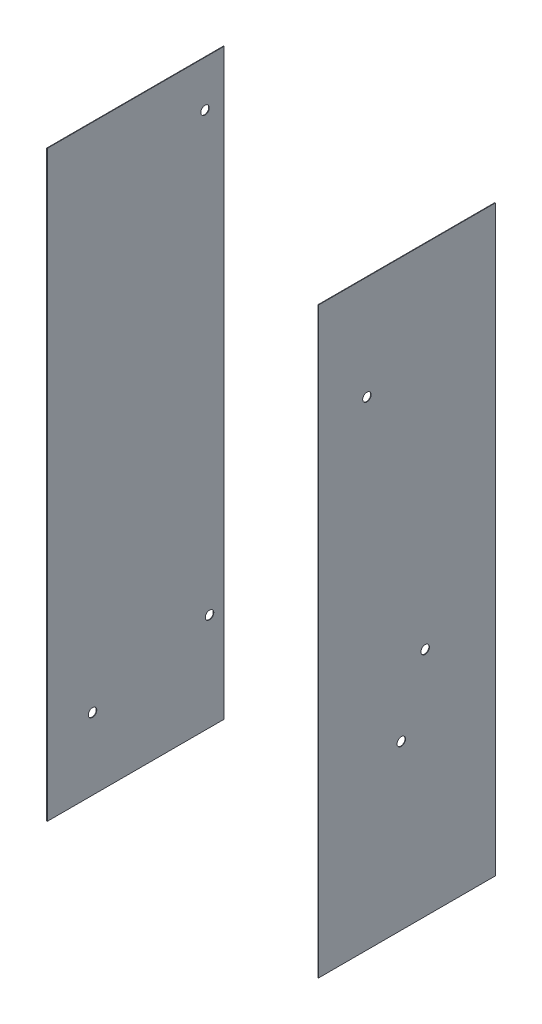
ISO-10303-21;
HEADER;
FILE_DESCRIPTION(('STEP AP214'),'2;1');
FILE_NAME('part.step','',(''),(''),'','','');
FILE_SCHEMA(('AUTOMOTIVE_DESIGN { 1 0 10303 214 1 1 1 1 }'));
ENDSEC;
DATA;
#1=APPLICATION_CONTEXT('core data for automotive mechanical design processes');
#2=APPLICATION_PROTOCOL_DEFINITION('international standard','automotive_design',2000,#1);
#3=PRODUCT_CONTEXT('',#1,'mechanical');
#4=PRODUCT('Part','Part','',(#3));
#5=PRODUCT_RELATED_PRODUCT_CATEGORY('part','',(#4));
#6=PRODUCT_DEFINITION_FORMATION('','',#4);
#7=PRODUCT_DEFINITION_CONTEXT('part definition',#1,'design');
#8=PRODUCT_DEFINITION('design','',#6,#7);
#9=PRODUCT_DEFINITION_SHAPE('','',#8);
#10=(LENGTH_UNIT() NAMED_UNIT(*) SI_UNIT(.MILLI.,.METRE.));
#11=(NAMED_UNIT(*) PLANE_ANGLE_UNIT() SI_UNIT($,.RADIAN.));
#12=(NAMED_UNIT(*) SI_UNIT($,.STERADIAN.) SOLID_ANGLE_UNIT());
#13=UNCERTAINTY_MEASURE_WITH_UNIT(LENGTH_MEASURE(1.E-05),#10,'distance_accuracy_value','');
#14=(GEOMETRIC_REPRESENTATION_CONTEXT(3) GLOBAL_UNCERTAINTY_ASSIGNED_CONTEXT((#13)) GLOBAL_UNIT_ASSIGNED_CONTEXT((#10,
#11,#12)) REPRESENTATION_CONTEXT('',''));
#15=CARTESIAN_POINT('',(0.,0.,0.));
#16=DIRECTION('',(0.,0.,1.));
#17=DIRECTION('',(1.,0.,0.));
#18=AXIS2_PLACEMENT_3D('',#15,#16,#17);
#19=CARTESIAN_POINT('',(-458.978,-984.25,-298.45));
#20=DIRECTION('',(0.,0.,1.));
#21=DIRECTION('',(-1.,0.,0.));
#22=AXIS2_PLACEMENT_3D('',#19,#20,#21);
#23=PLANE('',#22);
#24=DIRECTION('',(0.,1.,0.));
#25=VECTOR('',#24,1.);
#26=CARTESIAN_POINT('',(-457.2,-984.25,-298.45));
#27=LINE('',#26,#25);
#28=CARTESIAN_POINT('',(-457.2,-984.25,-298.45));
#29=VERTEX_POINT('',#28);
#30=CARTESIAN_POINT('',(-457.2,984.25,-298.45));
#31=VERTEX_POINT('',#30);
#32=EDGE_CURVE('E117',#29,#31,#27,.T.);
#33=ORIENTED_EDGE('',*,*,#32,.F.);
#34=DIRECTION('',(1.,0.,0.));
#35=VECTOR('',#34,1.);
#36=CARTESIAN_POINT('',(-458.978,-984.25,-298.45));
#37=LINE('',#36,#35);
#38=CARTESIAN_POINT('',(-458.978,-984.25,-298.45));
#39=VERTEX_POINT('',#38);
#40=EDGE_CURVE('E116',#39,#29,#37,.T.);
#41=ORIENTED_EDGE('',*,*,#40,.F.);
#42=DIRECTION('',(0.,1.,0.));
#43=VECTOR('',#42,1.);
#44=CARTESIAN_POINT('',(-458.978,-984.25,-298.45));
#45=LINE('',#44,#43);
#46=CARTESIAN_POINT('',(-458.978,984.25,-298.45));
#47=VERTEX_POINT('',#46);
#48=EDGE_CURVE('E110',#39,#47,#45,.T.);
#49=ORIENTED_EDGE('',*,*,#48,.T.);
#50=DIRECTION('',(1.,0.,0.));
#51=VECTOR('',#50,1.);
#52=CARTESIAN_POINT('',(-458.978,984.25,-298.45));
#53=LINE('',#52,#51);
#54=EDGE_CURVE('E12',#47,#31,#53,.T.);
#55=ORIENTED_EDGE('',*,*,#54,.T.);
#56=EDGE_LOOP('',(#33,#41,#49,#55));
#57=FACE_BOUND('',#56,.T.);
#58=ADVANCED_FACE('F50',(#57),#23,.F.);
#59=CARTESIAN_POINT('',(-458.978,984.25,-298.45));
#60=DIRECTION('',(0.,-1.,0.));
#61=DIRECTION('',(0.,0.,-1.));
#62=AXIS2_PLACEMENT_3D('',#59,#60,#61);
#63=PLANE('',#62);
#64=DIRECTION('',(0.,0.,1.));
#65=VECTOR('',#64,1.);
#66=CARTESIAN_POINT('',(-457.2,984.25,-298.45));
#67=LINE('',#66,#65);
#68=CARTESIAN_POINT('',(-457.2,984.25,298.45));
#69=VERTEX_POINT('',#68);
#70=EDGE_CURVE('E119',#31,#69,#67,.T.);
#71=ORIENTED_EDGE('',*,*,#70,.F.);
#72=ORIENTED_EDGE('',*,*,#54,.F.);
#73=DIRECTION('',(0.,0.,1.));
#74=VECTOR('',#73,1.);
#75=CARTESIAN_POINT('',(-458.978,984.25,-298.45));
#76=LINE('',#75,#74);
#77=CARTESIAN_POINT('',(-458.978,984.25,298.45));
#78=VERTEX_POINT('',#77);
#79=EDGE_CURVE('E93',#47,#78,#76,.T.);
#80=ORIENTED_EDGE('',*,*,#79,.T.);
#81=DIRECTION('',(1.,0.,0.));
#82=VECTOR('',#81,1.);
#83=CARTESIAN_POINT('',(-458.978,984.25,298.45));
#84=LINE('',#83,#82);
#85=EDGE_CURVE('E59',#78,#69,#84,.T.);
#86=ORIENTED_EDGE('',*,*,#85,.T.);
#87=EDGE_LOOP('',(#71,#72,#80,#86));
#88=FACE_BOUND('',#87,.T.);
#89=ADVANCED_FACE('F108',(#88),#63,.F.);
#90=CARTESIAN_POINT('',(-458.978,984.25,298.45));
#91=DIRECTION('',(0.,0.,-1.));
#92=DIRECTION('',(1.,0.,0.));
#93=AXIS2_PLACEMENT_3D('',#90,#91,#92);
#94=PLANE('',#93);
#95=DIRECTION('',(0.,-1.,0.));
#96=VECTOR('',#95,1.);
#97=CARTESIAN_POINT('',(-457.2,984.25,298.45));
#98=LINE('',#97,#96);
#99=CARTESIAN_POINT('',(-457.2,-984.25,298.45));
#100=VERTEX_POINT('',#99);
#101=EDGE_CURVE('E103',#69,#100,#98,.T.);
#102=ORIENTED_EDGE('',*,*,#101,.F.);
#103=ORIENTED_EDGE('',*,*,#85,.F.);
#104=DIRECTION('',(0.,-1.,0.));
#105=VECTOR('',#104,1.);
#106=CARTESIAN_POINT('',(-458.978,984.25,298.45));
#107=LINE('',#106,#105);
#108=CARTESIAN_POINT('',(-458.978,-984.25,298.45));
#109=VERTEX_POINT('',#108);
#110=EDGE_CURVE('E96',#78,#109,#107,.T.);
#111=ORIENTED_EDGE('',*,*,#110,.T.);
#112=DIRECTION('',(1.,0.,0.));
#113=VECTOR('',#112,1.);
#114=CARTESIAN_POINT('',(-458.978,-984.25,298.45));
#115=LINE('',#114,#113);
#116=EDGE_CURVE('E106',#109,#100,#115,.T.);
#117=ORIENTED_EDGE('',*,*,#116,.T.);
#118=EDGE_LOOP('',(#102,#103,#111,#117));
#119=FACE_BOUND('',#118,.T.);
#120=ADVANCED_FACE('F102',(#119),#94,.F.);
#121=CARTESIAN_POINT('',(-458.978,-984.25,298.45));
#122=DIRECTION('',(0.,1.,0.));
#123=DIRECTION('',(0.,0.,1.));
#124=AXIS2_PLACEMENT_3D('',#121,#122,#123);
#125=PLANE('',#124);
#126=DIRECTION('',(0.,0.,-1.));
#127=VECTOR('',#126,1.);
#128=CARTESIAN_POINT('',(-457.2,-984.25,298.45));
#129=LINE('',#128,#127);
#130=EDGE_CURVE('E82',#100,#29,#129,.T.);
#131=ORIENTED_EDGE('',*,*,#130,.F.);
#132=ORIENTED_EDGE('',*,*,#116,.F.);
#133=DIRECTION('',(0.,0.,-1.));
#134=VECTOR('',#133,1.);
#135=CARTESIAN_POINT('',(-458.978,-984.25,298.45));
#136=LINE('',#135,#134);
#137=EDGE_CURVE('E68',#109,#39,#136,.T.);
#138=ORIENTED_EDGE('',*,*,#137,.T.);
#139=ORIENTED_EDGE('',*,*,#40,.T.);
#140=EDGE_LOOP('',(#131,#132,#138,#139));
#141=FACE_BOUND('',#140,.T.);
#142=ADVANCED_FACE('F159',(#141),#125,.F.);
#143=CARTESIAN_POINT('',(-458.978,0.,0.));
#144=DIRECTION('',(-1.,0.,0.));
#145=DIRECTION('',(0.,0.,-1.));
#146=AXIS2_PLACEMENT_3D('',#143,#144,#145);
#147=PLANE('',#146);
#148=CARTESIAN_POINT('',(-458.978,-742.26734411053,145.541999999999));
#149=DIRECTION('',(-1.,0.,0.));
#150=DIRECTION('',(0.,0.,1.));
#151=AXIS2_PLACEMENT_3D('',#148,#149,#150);
#152=CIRCLE('',#151,14.2875000000001);
#153=CARTESIAN_POINT('',(-458.978,-742.26734411053,159.829499999999));
#154=VERTEX_POINT('',#153);
#155=EDGE_CURVE('E131',#154,#154,#152,.F.);
#156=ORIENTED_EDGE('',*,*,#155,.T.);
#157=EDGE_LOOP('',(#156));
#158=FACE_BOUND('',#157,.T.);
#159=CARTESIAN_POINT('',(-458.978,-654.63734411053,-249.669300000001));
#160=DIRECTION('',(-1.,0.,0.));
#161=DIRECTION('',(0.,0.,1.));
#162=AXIS2_PLACEMENT_3D('',#159,#160,#161);
#163=CIRCLE('',#162,14.2875000000001);
#164=CARTESIAN_POINT('',(-458.978,-654.63734411053,-235.381800000001));
#165=VERTEX_POINT('',#164);
#166=EDGE_CURVE('E128',#165,#165,#163,.F.);
#167=ORIENTED_EDGE('',*,*,#166,.T.);
#168=EDGE_LOOP('',(#167));
#169=FACE_BOUND('',#168,.T.);
#170=CARTESIAN_POINT('',(-458.978,829.52275588947,-234.315));
#171=DIRECTION('',(-1.,0.,0.));
#172=DIRECTION('',(0.,0.,1.));
#173=AXIS2_PLACEMENT_3D('',#170,#171,#172);
#174=CIRCLE('',#173,14.2875);
#175=CARTESIAN_POINT('',(-458.978,829.52275588947,-220.0275));
#176=VERTEX_POINT('',#175);
#177=EDGE_CURVE('E120',#176,#176,#174,.F.);
#178=ORIENTED_EDGE('',*,*,#177,.T.);
#179=EDGE_LOOP('',(#178));
#180=FACE_BOUND('',#179,.T.);
#181=ORIENTED_EDGE('',*,*,#48,.F.);
#182=ORIENTED_EDGE('',*,*,#137,.F.);
#183=ORIENTED_EDGE('',*,*,#110,.F.);
#184=ORIENTED_EDGE('',*,*,#79,.F.);
#185=EDGE_LOOP('',(#181,#182,#183,#184));
#186=FACE_BOUND('',#185,.T.);
#187=ADVANCED_FACE('F98',(#158,#169,#180,#186),#147,.T.);
#188=CARTESIAN_POINT('',(-457.2,0.,0.));
#189=DIRECTION('',(-1.,0.,0.));
#190=DIRECTION('',(0.,0.,-1.));
#191=AXIS2_PLACEMENT_3D('',#188,#189,#190);
#192=PLANE('',#191);
#193=CARTESIAN_POINT('',(-457.2,-742.26734411053,145.541999999999));
#194=DIRECTION('',(-1.,0.,0.));
#195=DIRECTION('',(0.,0.,1.));
#196=AXIS2_PLACEMENT_3D('',#193,#194,#195);
#197=CIRCLE('',#196,14.2875000000001);
#198=CARTESIAN_POINT('',(-457.2,-742.26734411053,159.829499999999));
#199=VERTEX_POINT('',#198);
#200=EDGE_CURVE('E53',#199,#199,#197,.F.);
#201=ORIENTED_EDGE('',*,*,#200,.F.);
#202=EDGE_LOOP('',(#201));
#203=FACE_BOUND('',#202,.T.);
#204=CARTESIAN_POINT('',(-457.2,-654.63734411053,-249.669300000001));
#205=DIRECTION('',(-1.,0.,0.));
#206=DIRECTION('',(0.,0.,1.));
#207=AXIS2_PLACEMENT_3D('',#204,#205,#206);
#208=CIRCLE('',#207,14.2875000000001);
#209=CARTESIAN_POINT('',(-457.2,-654.63734411053,-235.381800000001));
#210=VERTEX_POINT('',#209);
#211=EDGE_CURVE('E129',#210,#210,#208,.F.);
#212=ORIENTED_EDGE('',*,*,#211,.F.);
#213=EDGE_LOOP('',(#212));
#214=FACE_BOUND('',#213,.T.);
#215=CARTESIAN_POINT('',(-457.2,829.52275588947,-234.315));
#216=DIRECTION('',(-1.,0.,0.));
#217=DIRECTION('',(0.,0.,1.));
#218=AXIS2_PLACEMENT_3D('',#215,#216,#217);
#219=CIRCLE('',#218,14.2875);
#220=CARTESIAN_POINT('',(-457.2,829.52275588947,-220.0275));
#221=VERTEX_POINT('',#220);
#222=EDGE_CURVE('E126',#221,#221,#219,.F.);
#223=ORIENTED_EDGE('',*,*,#222,.F.);
#224=EDGE_LOOP('',(#223));
#225=FACE_BOUND('',#224,.T.);
#226=ORIENTED_EDGE('',*,*,#32,.T.);
#227=ORIENTED_EDGE('',*,*,#70,.T.);
#228=ORIENTED_EDGE('',*,*,#101,.T.);
#229=ORIENTED_EDGE('',*,*,#130,.T.);
#230=EDGE_LOOP('',(#226,#227,#228,#229));
#231=FACE_BOUND('',#230,.T.);
#232=ADVANCED_FACE('F149',(#203,#214,#225,#231),#192,.F.);
#233=CARTESIAN_POINT('',(-491.998,829.52275588947,-234.315));
#234=DIRECTION('',(1.,0.,0.));
#235=DIRECTION('',(0.,0.,-1.));
#236=AXIS2_PLACEMENT_3D('',#233,#234,#235);
#237=CYLINDRICAL_SURFACE('',#236,14.2875);
#238=ORIENTED_EDGE('',*,*,#177,.F.);
#239=EDGE_LOOP('',(#238));
#240=FACE_BOUND('',#239,.T.);
#241=ORIENTED_EDGE('',*,*,#222,.T.);
#242=EDGE_LOOP('',(#241));
#243=FACE_BOUND('',#242,.T.);
#244=ADVANCED_FACE('F145',(#240,#243),#237,.F.);
#245=CARTESIAN_POINT('',(-491.998,-654.63734411053,-249.669300000001));
#246=DIRECTION('',(1.,0.,0.));
#247=DIRECTION('',(0.,0.,-1.));
#248=AXIS2_PLACEMENT_3D('',#245,#246,#247);
#249=CYLINDRICAL_SURFACE('',#248,14.2875000000001);
#250=ORIENTED_EDGE('',*,*,#166,.F.);
#251=EDGE_LOOP('',(#250));
#252=FACE_BOUND('',#251,.T.);
#253=ORIENTED_EDGE('',*,*,#211,.T.);
#254=EDGE_LOOP('',(#253));
#255=FACE_BOUND('',#254,.T.);
#256=ADVANCED_FACE('F148',(#252,#255),#249,.F.);
#257=CARTESIAN_POINT('',(-491.998,-742.26734411053,145.541999999999));
#258=DIRECTION('',(1.,0.,0.));
#259=DIRECTION('',(0.,0.,-1.));
#260=AXIS2_PLACEMENT_3D('',#257,#258,#259);
#261=CYLINDRICAL_SURFACE('',#260,14.2875000000001);
#262=ORIENTED_EDGE('',*,*,#155,.F.);
#263=EDGE_LOOP('',(#262));
#264=FACE_BOUND('',#263,.T.);
#265=ORIENTED_EDGE('',*,*,#200,.T.);
#266=EDGE_LOOP('',(#265));
#267=FACE_BOUND('',#266,.T.);
#268=ADVANCED_FACE('F209',(#264,#267),#261,.F.);
#269=CLOSED_SHELL('',(#58,#89,#120,#142,#187,#232,#244,#256,#268));
#270=MANIFOLD_SOLID_BREP('B2',#269);
#271=CARTESIAN_POINT('',(458.978,-984.25,-298.45));
#272=DIRECTION('',(0.,0.,1.));
#273=DIRECTION('',(1.,0.,0.));
#274=AXIS2_PLACEMENT_3D('',#271,#272,#273);
#275=PLANE('',#274);
#276=DIRECTION('',(0.,1.,0.));
#277=VECTOR('',#276,1.);
#278=CARTESIAN_POINT('',(457.2,-984.25,-298.45));
#279=LINE('',#278,#277);
#280=CARTESIAN_POINT('',(457.2,-984.25,-298.45));
#281=VERTEX_POINT('',#280);
#282=CARTESIAN_POINT('',(457.2,984.25,-298.45));
#283=VERTEX_POINT('',#282);
#284=EDGE_CURVE('E313',#281,#283,#279,.T.);
#285=ORIENTED_EDGE('',*,*,#284,.T.);
#286=DIRECTION('',(-1.,0.,0.));
#287=VECTOR('',#286,1.);
#288=CARTESIAN_POINT('',(458.978,984.25,-298.45));
#289=LINE('',#288,#287);
#290=CARTESIAN_POINT('',(458.978,984.25,-298.45));
#291=VERTEX_POINT('',#290);
#292=EDGE_CURVE('E48',#291,#283,#289,.T.);
#293=ORIENTED_EDGE('',*,*,#292,.F.);
#294=DIRECTION('',(0.,1.,0.));
#295=VECTOR('',#294,1.);
#296=CARTESIAN_POINT('',(458.978,-984.25,-298.45));
#297=LINE('',#296,#295);
#298=CARTESIAN_POINT('',(458.978,-984.25,-298.45));
#299=VERTEX_POINT('',#298);
#300=EDGE_CURVE('E300',#299,#291,#297,.T.);
#301=ORIENTED_EDGE('',*,*,#300,.F.);
#302=DIRECTION('',(-1.,0.,0.));
#303=VECTOR('',#302,1.);
#304=CARTESIAN_POINT('',(458.978,-984.25,-298.45));
#305=LINE('',#304,#303);
#306=EDGE_CURVE('E309',#299,#281,#305,.T.);
#307=ORIENTED_EDGE('',*,*,#306,.T.);
#308=EDGE_LOOP('',(#285,#293,#301,#307));
#309=FACE_BOUND('',#308,.T.);
#310=ADVANCED_FACE('F247',(#309),#275,.F.);
#311=CARTESIAN_POINT('',(458.978,984.25,-298.45));
#312=DIRECTION('',(0.,-1.,0.));
#313=DIRECTION('',(0.,0.,-1.));
#314=AXIS2_PLACEMENT_3D('',#311,#312,#313);
#315=PLANE('',#314);
#316=DIRECTION('',(0.,0.,1.));
#317=VECTOR('',#316,1.);
#318=CARTESIAN_POINT('',(457.2,984.25,-298.45));
#319=LINE('',#318,#317);
#320=CARTESIAN_POINT('',(457.2,984.25,298.45));
#321=VERTEX_POINT('',#320);
#322=EDGE_CURVE('E304',#283,#321,#319,.T.);
#323=ORIENTED_EDGE('',*,*,#322,.T.);
#324=DIRECTION('',(-1.,0.,0.));
#325=VECTOR('',#324,1.);
#326=CARTESIAN_POINT('',(458.978,984.25,298.45));
#327=LINE('',#326,#325);
#328=CARTESIAN_POINT('',(458.978,984.25,298.45));
#329=VERTEX_POINT('',#328);
#330=EDGE_CURVE('E256',#329,#321,#327,.T.);
#331=ORIENTED_EDGE('',*,*,#330,.F.);
#332=DIRECTION('',(0.,0.,1.));
#333=VECTOR('',#332,1.);
#334=CARTESIAN_POINT('',(458.978,984.25,-298.45));
#335=LINE('',#334,#333);
#336=EDGE_CURVE('E295',#291,#329,#335,.T.);
#337=ORIENTED_EDGE('',*,*,#336,.F.);
#338=ORIENTED_EDGE('',*,*,#292,.T.);
#339=EDGE_LOOP('',(#323,#331,#337,#338));
#340=FACE_BOUND('',#339,.T.);
#341=ADVANCED_FACE('F303',(#340),#315,.F.);
#342=CARTESIAN_POINT('',(458.978,984.25,298.45));
#343=DIRECTION('',(0.,0.,-1.));
#344=DIRECTION('',(-1.,0.,0.));
#345=AXIS2_PLACEMENT_3D('',#342,#343,#344);
#346=PLANE('',#345);
#347=DIRECTION('',(0.,-1.,0.));
#348=VECTOR('',#347,1.);
#349=CARTESIAN_POINT('',(457.2,984.25,298.45));
#350=LINE('',#349,#348);
#351=CARTESIAN_POINT('',(457.2,-984.25,298.45));
#352=VERTEX_POINT('',#351);
#353=EDGE_CURVE('E282',#321,#352,#350,.T.);
#354=ORIENTED_EDGE('',*,*,#353,.T.);
#355=DIRECTION('',(-1.,0.,0.));
#356=VECTOR('',#355,1.);
#357=CARTESIAN_POINT('',(458.978,-984.25,298.45));
#358=LINE('',#357,#356);
#359=CARTESIAN_POINT('',(458.978,-984.25,298.45));
#360=VERTEX_POINT('',#359);
#361=EDGE_CURVE('E305',#360,#352,#358,.T.);
#362=ORIENTED_EDGE('',*,*,#361,.F.);
#363=DIRECTION('',(0.,-1.,0.));
#364=VECTOR('',#363,1.);
#365=CARTESIAN_POINT('',(458.978,984.25,298.45));
#366=LINE('',#365,#364);
#367=EDGE_CURVE('E298',#329,#360,#366,.T.);
#368=ORIENTED_EDGE('',*,*,#367,.F.);
#369=ORIENTED_EDGE('',*,*,#330,.T.);
#370=EDGE_LOOP('',(#354,#362,#368,#369));
#371=FACE_BOUND('',#370,.T.);
#372=ADVANCED_FACE('F307',(#371),#346,.F.);
#373=CARTESIAN_POINT('',(458.978,-984.25,298.45));
#374=DIRECTION('',(0.,1.,0.));
#375=DIRECTION('',(0.,0.,1.));
#376=AXIS2_PLACEMENT_3D('',#373,#374,#375);
#377=PLANE('',#376);
#378=DIRECTION('',(0.,0.,-1.));
#379=VECTOR('',#378,1.);
#380=CARTESIAN_POINT('',(457.2,-984.25,298.45));
#381=LINE('',#380,#379);
#382=EDGE_CURVE('E288',#352,#281,#381,.T.);
#383=ORIENTED_EDGE('',*,*,#382,.T.);
#384=ORIENTED_EDGE('',*,*,#306,.F.);
#385=DIRECTION('',(0.,0.,-1.));
#386=VECTOR('',#385,1.);
#387=CARTESIAN_POINT('',(458.978,-984.25,298.45));
#388=LINE('',#387,#386);
#389=EDGE_CURVE('E265',#360,#299,#388,.T.);
#390=ORIENTED_EDGE('',*,*,#389,.F.);
#391=ORIENTED_EDGE('',*,*,#361,.T.);
#392=EDGE_LOOP('',(#383,#384,#390,#391));
#393=FACE_BOUND('',#392,.T.);
#394=ADVANCED_FACE('F347',(#393),#377,.F.);
#395=CARTESIAN_POINT('',(458.978,0.,0.));
#396=DIRECTION('',(1.,0.,0.));
#397=DIRECTION('',(0.,0.,-1.));
#398=AXIS2_PLACEMENT_3D('',#395,#396,#397);
#399=PLANE('',#398);
#400=CARTESIAN_POINT('',(458.978,633.21184,135.025897322712));
#401=DIRECTION('',(1.,0.,0.));
#402=DIRECTION('',(0.,0.,-1.));
#403=AXIS2_PLACEMENT_3D('',#400,#401,#402);
#404=CIRCLE('',#403,14.2875);
#405=CARTESIAN_POINT('',(458.978,633.21184,120.738397322712));
#406=VERTEX_POINT('',#405);
#407=EDGE_CURVE('E336',#406,#406,#404,.T.);
#408=ORIENTED_EDGE('',*,*,#407,.F.);
#409=EDGE_LOOP('',(#408));
#410=FACE_BOUND('',#409,.T.);
#411=CARTESIAN_POINT('',(458.978,-432.196844110543,19.0499999999999));
#412=DIRECTION('',(1.,0.,0.));
#413=DIRECTION('',(0.,0.,-1.));
#414=AXIS2_PLACEMENT_3D('',#411,#412,#413);
#415=CIRCLE('',#414,14.2875);
#416=CARTESIAN_POINT('',(458.978,-432.196844110543,4.76249999999994));
#417=VERTEX_POINT('',#416);
#418=EDGE_CURVE('E326',#417,#417,#415,.T.);
#419=ORIENTED_EDGE('',*,*,#418,.F.);
#420=EDGE_LOOP('',(#419));
#421=FACE_BOUND('',#420,.T.);
#422=CARTESIAN_POINT('',(458.978,-203.419044110543,-61.7093000000001));
#423=DIRECTION('',(1.,0.,0.));
#424=DIRECTION('',(0.,0.,-1.));
#425=AXIS2_PLACEMENT_3D('',#422,#423,#424);
#426=CIRCLE('',#425,14.2875);
#427=CARTESIAN_POINT('',(458.978,-203.419044110543,-75.9968000000001));
#428=VERTEX_POINT('',#427);
#429=EDGE_CURVE('E323',#428,#428,#426,.T.);
#430=ORIENTED_EDGE('',*,*,#429,.F.);
#431=EDGE_LOOP('',(#430));
#432=FACE_BOUND('',#431,.T.);
#433=ORIENTED_EDGE('',*,*,#300,.T.);
#434=ORIENTED_EDGE('',*,*,#336,.T.);
#435=ORIENTED_EDGE('',*,*,#367,.T.);
#436=ORIENTED_EDGE('',*,*,#389,.T.);
#437=EDGE_LOOP('',(#433,#434,#435,#436));
#438=FACE_BOUND('',#437,.T.);
#439=ADVANCED_FACE('F296',(#410,#421,#432,#438),#399,.T.);
#440=CARTESIAN_POINT('',(457.2,0.,0.));
#441=DIRECTION('',(1.,0.,0.));
#442=DIRECTION('',(0.,0.,-1.));
#443=AXIS2_PLACEMENT_3D('',#440,#441,#442);
#444=PLANE('',#443);
#445=CARTESIAN_POINT('',(457.2,633.21184,135.025897322712));
#446=DIRECTION('',(1.,0.,0.));
#447=DIRECTION('',(0.,0.,-1.));
#448=AXIS2_PLACEMENT_3D('',#445,#446,#447);
#449=CIRCLE('',#448,14.2875);
#450=CARTESIAN_POINT('',(457.2,633.21184,120.738397322712));
#451=VERTEX_POINT('',#450);
#452=EDGE_CURVE('E250',#451,#451,#449,.T.);
#453=ORIENTED_EDGE('',*,*,#452,.T.);
#454=EDGE_LOOP('',(#453));
#455=FACE_BOUND('',#454,.T.);
#456=CARTESIAN_POINT('',(457.2,-432.196844110543,19.0499999999999));
#457=DIRECTION('',(1.,0.,0.));
#458=DIRECTION('',(0.,0.,-1.));
#459=AXIS2_PLACEMENT_3D('',#456,#457,#458);
#460=CIRCLE('',#459,14.2875);
#461=CARTESIAN_POINT('',(457.2,-432.196844110543,4.76249999999994));
#462=VERTEX_POINT('',#461);
#463=EDGE_CURVE('E324',#462,#462,#460,.T.);
#464=ORIENTED_EDGE('',*,*,#463,.T.);
#465=EDGE_LOOP('',(#464));
#466=FACE_BOUND('',#465,.T.);
#467=CARTESIAN_POINT('',(457.2,-203.419044110543,-61.7093000000001));
#468=DIRECTION('',(1.,0.,0.));
#469=DIRECTION('',(0.,0.,-1.));
#470=AXIS2_PLACEMENT_3D('',#467,#468,#469);
#471=CIRCLE('',#470,14.2875);
#472=CARTESIAN_POINT('',(457.2,-203.419044110543,-75.9968000000001));
#473=VERTEX_POINT('',#472);
#474=EDGE_CURVE('E316',#473,#473,#471,.T.);
#475=ORIENTED_EDGE('',*,*,#474,.T.);
#476=EDGE_LOOP('',(#475));
#477=FACE_BOUND('',#476,.T.);
#478=ORIENTED_EDGE('',*,*,#284,.F.);
#479=ORIENTED_EDGE('',*,*,#382,.F.);
#480=ORIENTED_EDGE('',*,*,#353,.F.);
#481=ORIENTED_EDGE('',*,*,#322,.F.);
#482=EDGE_LOOP('',(#478,#479,#480,#481));
#483=FACE_BOUND('',#482,.T.);
#484=ADVANCED_FACE('F346',(#455,#466,#477,#483),#444,.F.);
#485=CARTESIAN_POINT('',(456.438,-203.419044110543,-61.7093000000001));
#486=DIRECTION('',(1.,0.,0.));
#487=DIRECTION('',(0.,0.,-1.));
#488=AXIS2_PLACEMENT_3D('',#485,#486,#487);
#489=CYLINDRICAL_SURFACE('',#488,14.2875);
#490=ORIENTED_EDGE('',*,*,#429,.T.);
#491=EDGE_LOOP('',(#490));
#492=FACE_BOUND('',#491,.T.);
#493=ORIENTED_EDGE('',*,*,#474,.F.);
#494=EDGE_LOOP('',(#493));
#495=FACE_BOUND('',#494,.T.);
#496=ADVANCED_FACE('F352',(#492,#495),#489,.F.);
#497=CARTESIAN_POINT('',(456.438,-432.196844110543,19.0499999999999));
#498=DIRECTION('',(1.,0.,0.));
#499=DIRECTION('',(0.,0.,-1.));
#500=AXIS2_PLACEMENT_3D('',#497,#498,#499);
#501=CYLINDRICAL_SURFACE('',#500,14.2875);
#502=ORIENTED_EDGE('',*,*,#418,.T.);
#503=EDGE_LOOP('',(#502));
#504=FACE_BOUND('',#503,.T.);
#505=ORIENTED_EDGE('',*,*,#463,.F.);
#506=EDGE_LOOP('',(#505));
#507=FACE_BOUND('',#506,.T.);
#508=ADVANCED_FACE('F355',(#504,#507),#501,.F.);
#509=CARTESIAN_POINT('',(456.438,633.21184,135.025897322712));
#510=DIRECTION('',(1.,0.,0.));
#511=DIRECTION('',(0.,0.,-1.));
#512=AXIS2_PLACEMENT_3D('',#509,#510,#511);
#513=CYLINDRICAL_SURFACE('',#512,14.2875);
#514=ORIENTED_EDGE('',*,*,#407,.T.);
#515=EDGE_LOOP('',(#514));
#516=FACE_BOUND('',#515,.T.);
#517=ORIENTED_EDGE('',*,*,#452,.F.);
#518=EDGE_LOOP('',(#517));
#519=FACE_BOUND('',#518,.T.);
#520=ADVANCED_FACE('F341',(#516,#519),#513,.F.);
#521=CLOSED_SHELL('',(#310,#341,#372,#394,#439,#484,#496,#508,#520));
#522=MANIFOLD_SOLID_BREP('B6',#521);
#523=ADVANCED_BREP_SHAPE_REPRESENTATION('',(#18,#270,#522),#14);
#524=SHAPE_DEFINITION_REPRESENTATION(#9,#523);
ENDSEC;
END-ISO-10303-21;
